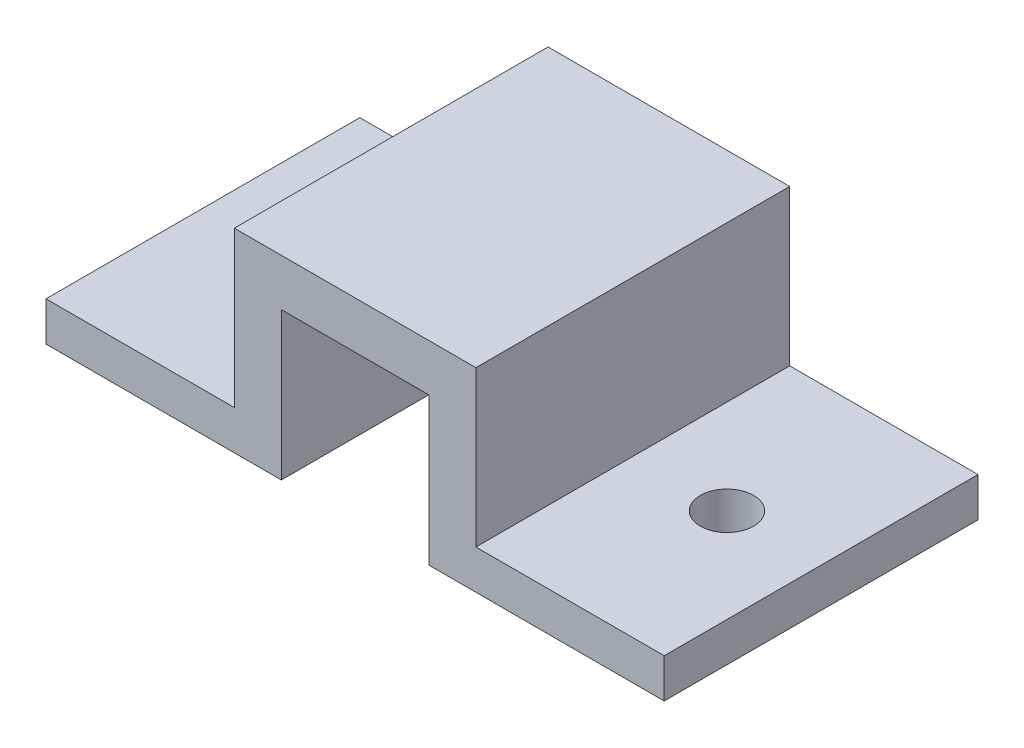
ISO-10303-21;
HEADER;
FILE_DESCRIPTION(('STEP AP214'),'2;1');
FILE_NAME('part.step','',(''),(''),'','','');
FILE_SCHEMA(('AUTOMOTIVE_DESIGN { 1 0 10303 214 1 1 1 1 }'));
ENDSEC;
DATA;
#1=APPLICATION_CONTEXT('core data for automotive mechanical design processes');
#2=APPLICATION_PROTOCOL_DEFINITION('international standard','automotive_design',2000,#1);
#3=PRODUCT_CONTEXT('',#1,'mechanical');
#4=PRODUCT('Part','Part','',(#3));
#5=PRODUCT_RELATED_PRODUCT_CATEGORY('part','',(#4));
#6=PRODUCT_DEFINITION_FORMATION('','',#4);
#7=PRODUCT_DEFINITION_CONTEXT('part definition',#1,'design');
#8=PRODUCT_DEFINITION('design','',#6,#7);
#9=PRODUCT_DEFINITION_SHAPE('','',#8);
#10=(LENGTH_UNIT() NAMED_UNIT(*) SI_UNIT(.MILLI.,.METRE.));
#11=(NAMED_UNIT(*) PLANE_ANGLE_UNIT() SI_UNIT($,.RADIAN.));
#12=(NAMED_UNIT(*) SI_UNIT($,.STERADIAN.) SOLID_ANGLE_UNIT());
#13=UNCERTAINTY_MEASURE_WITH_UNIT(LENGTH_MEASURE(1.E-05),#10,'distance_accuracy_value','');
#14=(GEOMETRIC_REPRESENTATION_CONTEXT(3) GLOBAL_UNCERTAINTY_ASSIGNED_CONTEXT((#13)) GLOBAL_UNIT_ASSIGNED_CONTEXT((#10,
#11,#12)) REPRESENTATION_CONTEXT('',''));
#15=CARTESIAN_POINT('',(0.,0.,0.));
#16=DIRECTION('',(0.,0.,1.));
#17=DIRECTION('',(1.,0.,0.));
#18=AXIS2_PLACEMENT_3D('',#15,#16,#17);
#19=CARTESIAN_POINT('',(21.9787589866717,-10.1497377982631,25.4));
#20=DIRECTION('',(-1.,0.,0.));
#21=DIRECTION('',(0.,0.,1.));
#22=AXIS2_PLACEMENT_3D('',#19,#20,#21);
#23=PLANE('',#22);
#24=DIRECTION('',(0.,1.,0.));
#25=VECTOR('',#24,1.);
#26=CARTESIAN_POINT('',(21.9787589866717,-10.1497377982631,0.));
#27=LINE('',#26,#25);
#28=CARTESIAN_POINT('',(21.9787589866717,-10.1497377982631,0.));
#29=VERTEX_POINT('',#28);
#30=CARTESIAN_POINT('',(21.9787589866717,-6.97473779826315,0.));
#31=VERTEX_POINT('',#30);
#32=EDGE_CURVE('E156',#29,#31,#27,.T.);
#33=ORIENTED_EDGE('',*,*,#32,.T.);
#34=DIRECTION('',(0.,0.,-1.));
#35=VECTOR('',#34,1.);
#36=CARTESIAN_POINT('',(21.9787589866717,-6.97473779826315,25.4));
#37=LINE('',#36,#35);
#38=CARTESIAN_POINT('',(21.9787589866717,-6.97473779826315,25.4));
#39=VERTEX_POINT('',#38);
#40=EDGE_CURVE('E11',#39,#31,#37,.T.);
#41=ORIENTED_EDGE('',*,*,#40,.F.);
#42=DIRECTION('',(0.,1.,0.));
#43=VECTOR('',#42,1.);
#44=CARTESIAN_POINT('',(21.9787589866717,-10.1497377982631,25.4));
#45=LINE('',#44,#43);
#46=CARTESIAN_POINT('',(21.9787589866717,-10.1497377982631,25.4));
#47=VERTEX_POINT('',#46);
#48=EDGE_CURVE('E179',#47,#39,#45,.T.);
#49=ORIENTED_EDGE('',*,*,#48,.F.);
#50=DIRECTION('',(0.,0.,-1.));
#51=VECTOR('',#50,1.);
#52=CARTESIAN_POINT('',(21.9787589866717,-10.1497377982631,25.4));
#53=LINE('',#52,#51);
#54=EDGE_CURVE('E152',#47,#29,#53,.T.);
#55=ORIENTED_EDGE('',*,*,#54,.T.);
#56=EDGE_LOOP('',(#33,#41,#49,#55));
#57=FACE_BOUND('',#56,.T.);
#58=ADVANCED_FACE('F34',(#57),#23,.F.);
#59=CARTESIAN_POINT('',(6.73875898667166,-6.97473779826315,25.4));
#60=DIRECTION('',(0.,-1.,0.));
#61=DIRECTION('',(0.,0.,-1.));
#62=AXIS2_PLACEMENT_3D('',#59,#60,#61);
#63=PLANE('',#62);
#64=CARTESIAN_POINT('',(14.3587589866717,-6.97473779826315,12.7));
#65=DIRECTION('',(0.,1.,0.));
#66=DIRECTION('',(0.,0.,1.));
#67=AXIS2_PLACEMENT_3D('',#64,#65,#66);
#68=CIRCLE('',#67,2.159);
#69=CARTESIAN_POINT('',(14.3587589866717,-6.97473779826315,14.859));
#70=VERTEX_POINT('',#69);
#71=EDGE_CURVE('E203',#70,#70,#68,.T.);
#72=ORIENTED_EDGE('',*,*,#71,.F.);
#73=EDGE_LOOP('',(#72));
#74=FACE_BOUND('',#73,.T.);
#75=DIRECTION('',(-1.,0.,0.));
#76=VECTOR('',#75,1.);
#77=CARTESIAN_POINT('',(6.73875898667166,-6.97473779826315,0.));
#78=LINE('',#77,#76);
#79=CARTESIAN_POINT('',(6.73875898667166,-6.97473779826315,0.));
#80=VERTEX_POINT('',#79);
#81=EDGE_CURVE('E159',#31,#80,#78,.T.);
#82=ORIENTED_EDGE('',*,*,#81,.T.);
#83=DIRECTION('',(0.,0.,-1.));
#84=VECTOR('',#83,1.);
#85=CARTESIAN_POINT('',(6.73875898667166,-6.97473779826315,25.4));
#86=LINE('',#85,#84);
#87=CARTESIAN_POINT('',(6.73875898667166,-6.97473779826315,25.4));
#88=VERTEX_POINT('',#87);
#89=EDGE_CURVE('E43',#88,#80,#86,.T.);
#90=ORIENTED_EDGE('',*,*,#89,.F.);
#91=DIRECTION('',(-1.,0.,0.));
#92=VECTOR('',#91,1.);
#93=CARTESIAN_POINT('',(6.73875898667166,-6.97473779826315,25.4));
#94=LINE('',#93,#92);
#95=EDGE_CURVE('E107',#39,#88,#94,.T.);
#96=ORIENTED_EDGE('',*,*,#95,.F.);
#97=ORIENTED_EDGE('',*,*,#40,.T.);
#98=EDGE_LOOP('',(#82,#90,#96,#97));
#99=FACE_BOUND('',#98,.T.);
#100=ADVANCED_FACE('F255',(#74,#99),#63,.F.);
#101=CARTESIAN_POINT('',(6.73875898667166,5.59826220173685,25.4));
#102=DIRECTION('',(-1.,0.,0.));
#103=DIRECTION('',(0.,0.,1.));
#104=AXIS2_PLACEMENT_3D('',#101,#102,#103);
#105=PLANE('',#104);
#106=DIRECTION('',(0.,1.,0.));
#107=VECTOR('',#106,1.);
#108=CARTESIAN_POINT('',(6.73875898667166,5.59826220173685,0.));
#109=LINE('',#108,#107);
#110=CARTESIAN_POINT('',(6.73875898667166,5.59826220173685,0.));
#111=VERTEX_POINT('',#110);
#112=EDGE_CURVE('E162',#80,#111,#109,.T.);
#113=ORIENTED_EDGE('',*,*,#112,.T.);
#114=DIRECTION('',(0.,0.,-1.));
#115=VECTOR('',#114,1.);
#116=CARTESIAN_POINT('',(6.73875898667166,5.59826220173685,25.4));
#117=LINE('',#116,#115);
#118=CARTESIAN_POINT('',(6.73875898667166,5.59826220173685,25.4));
#119=VERTEX_POINT('',#118);
#120=EDGE_CURVE('E198',#119,#111,#117,.T.);
#121=ORIENTED_EDGE('',*,*,#120,.F.);
#122=DIRECTION('',(0.,1.,0.));
#123=VECTOR('',#122,1.);
#124=CARTESIAN_POINT('',(6.73875898667166,5.59826220173685,25.4));
#125=LINE('',#124,#123);
#126=EDGE_CURVE('E216',#88,#119,#125,.T.);
#127=ORIENTED_EDGE('',*,*,#126,.F.);
#128=ORIENTED_EDGE('',*,*,#89,.T.);
#129=EDGE_LOOP('',(#113,#121,#127,#128));
#130=FACE_BOUND('',#129,.T.);
#131=ADVANCED_FACE('F259',(#130),#105,.F.);
#132=CARTESIAN_POINT('',(-12.8192410133283,5.59826220173685,25.4));
#133=DIRECTION('',(0.,-1.,0.));
#134=DIRECTION('',(0.,0.,-1.));
#135=AXIS2_PLACEMENT_3D('',#132,#133,#134);
#136=PLANE('',#135);
#137=DIRECTION('',(-1.,0.,0.));
#138=VECTOR('',#137,1.);
#139=CARTESIAN_POINT('',(-12.8192410133283,5.59826220173685,0.));
#140=LINE('',#139,#138);
#141=CARTESIAN_POINT('',(-12.8192410133283,5.59826220173685,0.));
#142=VERTEX_POINT('',#141);
#143=EDGE_CURVE('E164',#111,#142,#140,.T.);
#144=ORIENTED_EDGE('',*,*,#143,.T.);
#145=DIRECTION('',(0.,0.,-1.));
#146=VECTOR('',#145,1.);
#147=CARTESIAN_POINT('',(-12.8192410133283,5.59826220173685,25.4));
#148=LINE('',#147,#146);
#149=CARTESIAN_POINT('',(-12.8192410133283,5.59826220173685,25.4));
#150=VERTEX_POINT('',#149);
#151=EDGE_CURVE('E195',#150,#142,#148,.T.);
#152=ORIENTED_EDGE('',*,*,#151,.F.);
#153=DIRECTION('',(-1.,0.,0.));
#154=VECTOR('',#153,1.);
#155=CARTESIAN_POINT('',(-12.8192410133283,5.59826220173685,25.4));
#156=LINE('',#155,#154);
#157=EDGE_CURVE('E218',#119,#150,#156,.T.);
#158=ORIENTED_EDGE('',*,*,#157,.F.);
#159=ORIENTED_EDGE('',*,*,#120,.T.);
#160=EDGE_LOOP('',(#144,#152,#158,#159));
#161=FACE_BOUND('',#160,.T.);
#162=ADVANCED_FACE('F264',(#161),#136,.F.);
#163=CARTESIAN_POINT('',(-12.8192410133283,-6.97473779826315,25.4));
#164=DIRECTION('',(1.,0.,0.));
#165=DIRECTION('',(0.,0.,-1.));
#166=AXIS2_PLACEMENT_3D('',#163,#164,#165);
#167=PLANE('',#166);
#168=DIRECTION('',(0.,-1.,0.));
#169=VECTOR('',#168,1.);
#170=CARTESIAN_POINT('',(-12.8192410133283,-6.97473779826315,0.));
#171=LINE('',#170,#169);
#172=CARTESIAN_POINT('',(-12.8192410133283,-6.97473779826315,0.));
#173=VERTEX_POINT('',#172);
#174=EDGE_CURVE('E166',#142,#173,#171,.T.);
#175=ORIENTED_EDGE('',*,*,#174,.T.);
#176=DIRECTION('',(0.,0.,-1.));
#177=VECTOR('',#176,1.);
#178=CARTESIAN_POINT('',(-12.8192410133283,-6.97473779826315,25.4));
#179=LINE('',#178,#177);
#180=CARTESIAN_POINT('',(-12.8192410133283,-6.97473779826315,25.4));
#181=VERTEX_POINT('',#180);
#182=EDGE_CURVE('E192',#181,#173,#179,.T.);
#183=ORIENTED_EDGE('',*,*,#182,.F.);
#184=DIRECTION('',(0.,-1.,0.));
#185=VECTOR('',#184,1.);
#186=CARTESIAN_POINT('',(-12.8192410133283,-6.97473779826315,25.4));
#187=LINE('',#186,#185);
#188=EDGE_CURVE('E220',#150,#181,#187,.T.);
#189=ORIENTED_EDGE('',*,*,#188,.F.);
#190=ORIENTED_EDGE('',*,*,#151,.T.);
#191=EDGE_LOOP('',(#175,#183,#189,#190));
#192=FACE_BOUND('',#191,.T.);
#193=ADVANCED_FACE('F270',(#192),#167,.F.);
#194=CARTESIAN_POINT('',(-28.0592410133283,-6.97473779826315,25.4));
#195=DIRECTION('',(0.,-1.,0.));
#196=DIRECTION('',(0.,0.,-1.));
#197=AXIS2_PLACEMENT_3D('',#194,#195,#196);
#198=PLANE('',#197);
#199=CARTESIAN_POINT('',(-20.4392410133283,-6.97473779826315,12.7));
#200=DIRECTION('',(0.,1.,0.));
#201=DIRECTION('',(0.,0.,1.));
#202=AXIS2_PLACEMENT_3D('',#199,#200,#201);
#203=CIRCLE('',#202,2.159);
#204=CARTESIAN_POINT('',(-20.4392410133283,-6.97473779826315,14.859));
#205=VERTEX_POINT('',#204);
#206=EDGE_CURVE('E211',#205,#205,#203,.T.);
#207=ORIENTED_EDGE('',*,*,#206,.F.);
#208=EDGE_LOOP('',(#207));
#209=FACE_BOUND('',#208,.T.);
#210=DIRECTION('',(-1.,0.,0.));
#211=VECTOR('',#210,1.);
#212=CARTESIAN_POINT('',(-28.0592410133283,-6.97473779826315,0.));
#213=LINE('',#212,#211);
#214=CARTESIAN_POINT('',(-28.0592410133283,-6.97473779826315,0.));
#215=VERTEX_POINT('',#214);
#216=EDGE_CURVE('E168',#173,#215,#213,.T.);
#217=ORIENTED_EDGE('',*,*,#216,.T.);
#218=DIRECTION('',(0.,0.,-1.));
#219=VECTOR('',#218,1.);
#220=CARTESIAN_POINT('',(-28.0592410133283,-6.97473779826315,25.4));
#221=LINE('',#220,#219);
#222=CARTESIAN_POINT('',(-28.0592410133283,-6.97473779826315,25.4));
#223=VERTEX_POINT('',#222);
#224=EDGE_CURVE('E189',#223,#215,#221,.T.);
#225=ORIENTED_EDGE('',*,*,#224,.F.);
#226=DIRECTION('',(-1.,0.,0.));
#227=VECTOR('',#226,1.);
#228=CARTESIAN_POINT('',(-28.0592410133283,-6.97473779826315,25.4));
#229=LINE('',#228,#227);
#230=EDGE_CURVE('E222',#181,#223,#229,.T.);
#231=ORIENTED_EDGE('',*,*,#230,.F.);
#232=ORIENTED_EDGE('',*,*,#182,.T.);
#233=EDGE_LOOP('',(#217,#225,#231,#232));
#234=FACE_BOUND('',#233,.T.);
#235=ADVANCED_FACE('F274',(#209,#234),#198,.F.);
#236=CARTESIAN_POINT('',(-28.0592410133283,-10.1497377982632,25.4));
#237=DIRECTION('',(1.,0.,0.));
#238=DIRECTION('',(0.,0.,-1.));
#239=AXIS2_PLACEMENT_3D('',#236,#237,#238);
#240=PLANE('',#239);
#241=DIRECTION('',(0.,-1.,0.));
#242=VECTOR('',#241,1.);
#243=CARTESIAN_POINT('',(-28.0592410133283,-10.1497377982632,0.));
#244=LINE('',#243,#242);
#245=CARTESIAN_POINT('',(-28.0592410133283,-10.1497377982632,0.));
#246=VERTEX_POINT('',#245);
#247=EDGE_CURVE('E170',#215,#246,#244,.T.);
#248=ORIENTED_EDGE('',*,*,#247,.T.);
#249=DIRECTION('',(0.,0.,-1.));
#250=VECTOR('',#249,1.);
#251=CARTESIAN_POINT('',(-28.0592410133283,-10.1497377982632,25.4));
#252=LINE('',#251,#250);
#253=CARTESIAN_POINT('',(-28.0592410133283,-10.1497377982632,25.4));
#254=VERTEX_POINT('',#253);
#255=EDGE_CURVE('E186',#254,#246,#252,.T.);
#256=ORIENTED_EDGE('',*,*,#255,.F.);
#257=DIRECTION('',(0.,-1.,0.));
#258=VECTOR('',#257,1.);
#259=CARTESIAN_POINT('',(-28.0592410133283,-10.1497377982632,25.4));
#260=LINE('',#259,#258);
#261=EDGE_CURVE('E224',#223,#254,#260,.T.);
#262=ORIENTED_EDGE('',*,*,#261,.F.);
#263=ORIENTED_EDGE('',*,*,#224,.T.);
#264=EDGE_LOOP('',(#248,#256,#262,#263));
#265=FACE_BOUND('',#264,.T.);
#266=ADVANCED_FACE('F278',(#265),#240,.F.);
#267=CARTESIAN_POINT('',(-9.00924101332834,-10.1497377982631,25.4));
#268=DIRECTION('',(0.,1.,0.));
#269=DIRECTION('',(-1.,0.,0.));
#270=AXIS2_PLACEMENT_3D('',#267,#268,#269);
#271=PLANE('',#270);
#272=CARTESIAN_POINT('',(-20.4392410133283,-10.1497377982631,12.7));
#273=DIRECTION('',(0.,1.,0.));
#274=DIRECTION('',(-1.,0.,0.));
#275=AXIS2_PLACEMENT_3D('',#272,#273,#274);
#276=CIRCLE('',#275,2.159);
#277=CARTESIAN_POINT('',(-22.5982410133283,-10.1497377982631,12.7));
#278=VERTEX_POINT('',#277);
#279=EDGE_CURVE('E37',#278,#278,#276,.T.);
#280=ORIENTED_EDGE('',*,*,#279,.T.);
#281=EDGE_LOOP('',(#280));
#282=FACE_BOUND('',#281,.T.);
#283=DIRECTION('',(1.,0.,0.));
#284=VECTOR('',#283,1.);
#285=CARTESIAN_POINT('',(-9.00924101332834,-10.1497377982631,0.));
#286=LINE('',#285,#284);
#287=CARTESIAN_POINT('',(-9.00924101332834,-10.1497377982631,0.));
#288=VERTEX_POINT('',#287);
#289=EDGE_CURVE('E172',#246,#288,#286,.T.);
#290=ORIENTED_EDGE('',*,*,#289,.T.);
#291=DIRECTION('',(0.,0.,-1.));
#292=VECTOR('',#291,1.);
#293=CARTESIAN_POINT('',(-9.00924101332834,-10.1497377982631,25.4));
#294=LINE('',#293,#292);
#295=CARTESIAN_POINT('',(-9.00924101332834,-10.1497377982631,25.4));
#296=VERTEX_POINT('',#295);
#297=EDGE_CURVE('E183',#296,#288,#294,.T.);
#298=ORIENTED_EDGE('',*,*,#297,.F.);
#299=DIRECTION('',(1.,0.,0.));
#300=VECTOR('',#299,1.);
#301=CARTESIAN_POINT('',(-9.00924101332834,-10.1497377982631,25.4));
#302=LINE('',#301,#300);
#303=EDGE_CURVE('E226',#254,#296,#302,.T.);
#304=ORIENTED_EDGE('',*,*,#303,.F.);
#305=ORIENTED_EDGE('',*,*,#255,.T.);
#306=EDGE_LOOP('',(#290,#298,#304,#305));
#307=FACE_BOUND('',#306,.T.);
#308=ADVANCED_FACE('F232',(#282,#307),#271,.F.);
#309=CARTESIAN_POINT('',(-9.00924101332834,-10.1497377982631,25.4));
#310=DIRECTION('',(-1.,0.,0.));
#311=DIRECTION('',(0.,0.,1.));
#312=AXIS2_PLACEMENT_3D('',#309,#310,#311);
#313=PLANE('',#312);
#314=DIRECTION('',(0.,1.,0.));
#315=VECTOR('',#314,1.);
#316=CARTESIAN_POINT('',(-9.00924101332834,-10.1497377982631,0.));
#317=LINE('',#316,#315);
#318=CARTESIAN_POINT('',(-9.00924101332834,1.78826220173685,0.));
#319=VERTEX_POINT('',#318);
#320=EDGE_CURVE('E174',#288,#319,#317,.T.);
#321=ORIENTED_EDGE('',*,*,#320,.T.);
#322=DIRECTION('',(0.,0.,-1.));
#323=VECTOR('',#322,1.);
#324=CARTESIAN_POINT('',(-9.00924101332834,1.78826220173685,25.4));
#325=LINE('',#324,#323);
#326=CARTESIAN_POINT('',(-9.00924101332834,1.78826220173685,25.4));
#327=VERTEX_POINT('',#326);
#328=EDGE_CURVE('E147',#327,#319,#325,.T.);
#329=ORIENTED_EDGE('',*,*,#328,.F.);
#330=DIRECTION('',(0.,1.,0.));
#331=VECTOR('',#330,1.);
#332=CARTESIAN_POINT('',(-9.00924101332834,-10.1497377982631,25.4));
#333=LINE('',#332,#331);
#334=EDGE_CURVE('E138',#296,#327,#333,.T.);
#335=ORIENTED_EDGE('',*,*,#334,.F.);
#336=ORIENTED_EDGE('',*,*,#297,.T.);
#337=EDGE_LOOP('',(#321,#329,#335,#336));
#338=FACE_BOUND('',#337,.T.);
#339=ADVANCED_FACE('F236',(#338),#313,.F.);
#340=CARTESIAN_POINT('',(2.92875898667165,1.78826220173685,25.4));
#341=DIRECTION('',(0.,1.,0.));
#342=DIRECTION('',(-1.,0.,0.));
#343=AXIS2_PLACEMENT_3D('',#340,#341,#342);
#344=PLANE('',#343);
#345=DIRECTION('',(1.,0.,0.));
#346=VECTOR('',#345,1.);
#347=CARTESIAN_POINT('',(2.92875898667165,1.78826220173685,0.));
#348=LINE('',#347,#346);
#349=CARTESIAN_POINT('',(2.92875898667165,1.78826220173685,0.));
#350=VERTEX_POINT('',#349);
#351=EDGE_CURVE('E146',#319,#350,#348,.T.);
#352=ORIENTED_EDGE('',*,*,#351,.T.);
#353=DIRECTION('',(0.,0.,-1.));
#354=VECTOR('',#353,1.);
#355=CARTESIAN_POINT('',(2.92875898667165,1.78826220173685,25.4));
#356=LINE('',#355,#354);
#357=CARTESIAN_POINT('',(2.92875898667165,1.78826220173685,25.4));
#358=VERTEX_POINT('',#357);
#359=EDGE_CURVE('E143',#358,#350,#356,.T.);
#360=ORIENTED_EDGE('',*,*,#359,.F.);
#361=DIRECTION('',(1.,0.,0.));
#362=VECTOR('',#361,1.);
#363=CARTESIAN_POINT('',(2.92875898667165,1.78826220173685,25.4));
#364=LINE('',#363,#362);
#365=EDGE_CURVE('E132',#327,#358,#364,.T.);
#366=ORIENTED_EDGE('',*,*,#365,.F.);
#367=ORIENTED_EDGE('',*,*,#328,.T.);
#368=EDGE_LOOP('',(#352,#360,#366,#367));
#369=FACE_BOUND('',#368,.T.);
#370=ADVANCED_FACE('F144',(#369),#344,.F.);
#371=CARTESIAN_POINT('',(2.92875898667165,-10.1497377982631,25.4));
#372=DIRECTION('',(1.,0.,0.));
#373=DIRECTION('',(0.,0.,-1.));
#374=AXIS2_PLACEMENT_3D('',#371,#372,#373);
#375=PLANE('',#374);
#376=DIRECTION('',(0.,-1.,0.));
#377=VECTOR('',#376,1.);
#378=CARTESIAN_POINT('',(2.92875898667165,-10.1497377982631,0.));
#379=LINE('',#378,#377);
#380=CARTESIAN_POINT('',(2.92875898667165,-10.1497377982631,0.));
#381=VERTEX_POINT('',#380);
#382=EDGE_CURVE('E93',#350,#381,#379,.T.);
#383=ORIENTED_EDGE('',*,*,#382,.T.);
#384=DIRECTION('',(0.,0.,-1.));
#385=VECTOR('',#384,1.);
#386=CARTESIAN_POINT('',(2.92875898667165,-10.1497377982631,25.4));
#387=LINE('',#386,#385);
#388=CARTESIAN_POINT('',(2.92875898667165,-10.1497377982631,25.4));
#389=VERTEX_POINT('',#388);
#390=EDGE_CURVE('E148',#389,#381,#387,.T.);
#391=ORIENTED_EDGE('',*,*,#390,.F.);
#392=DIRECTION('',(0.,-1.,0.));
#393=VECTOR('',#392,1.);
#394=CARTESIAN_POINT('',(2.92875898667165,-10.1497377982631,25.4));
#395=LINE('',#394,#393);
#396=EDGE_CURVE('E136',#358,#389,#395,.T.);
#397=ORIENTED_EDGE('',*,*,#396,.F.);
#398=ORIENTED_EDGE('',*,*,#359,.T.);
#399=EDGE_LOOP('',(#383,#391,#397,#398));
#400=FACE_BOUND('',#399,.T.);
#401=ADVANCED_FACE('F150',(#400),#375,.F.);
#402=CARTESIAN_POINT('',(21.9787589866717,-10.1497377982631,25.4));
#403=DIRECTION('',(0.,1.,0.));
#404=DIRECTION('',(-1.,0.,0.));
#405=AXIS2_PLACEMENT_3D('',#402,#403,#404);
#406=PLANE('',#405);
#407=CARTESIAN_POINT('',(14.3587589866717,-10.1497377982631,12.7));
#408=DIRECTION('',(0.,1.,0.));
#409=DIRECTION('',(-1.,0.,0.));
#410=AXIS2_PLACEMENT_3D('',#407,#408,#409);
#411=CIRCLE('',#410,2.159);
#412=CARTESIAN_POINT('',(12.1997589866717,-10.1497377982631,12.7));
#413=VERTEX_POINT('',#412);
#414=EDGE_CURVE('E160',#413,#413,#411,.T.);
#415=ORIENTED_EDGE('',*,*,#414,.T.);
#416=EDGE_LOOP('',(#415));
#417=FACE_BOUND('',#416,.T.);
#418=DIRECTION('',(1.,0.,0.));
#419=VECTOR('',#418,1.);
#420=CARTESIAN_POINT('',(21.9787589866717,-10.1497377982631,0.));
#421=LINE('',#420,#419);
#422=EDGE_CURVE('E99',#381,#29,#421,.T.);
#423=ORIENTED_EDGE('',*,*,#422,.T.);
#424=ORIENTED_EDGE('',*,*,#54,.F.);
#425=DIRECTION('',(1.,0.,0.));
#426=VECTOR('',#425,1.);
#427=CARTESIAN_POINT('',(21.9787589866717,-10.1497377982631,25.4));
#428=LINE('',#427,#426);
#429=EDGE_CURVE('E52',#389,#47,#428,.T.);
#430=ORIENTED_EDGE('',*,*,#429,.F.);
#431=ORIENTED_EDGE('',*,*,#390,.T.);
#432=EDGE_LOOP('',(#423,#424,#430,#431));
#433=FACE_BOUND('',#432,.T.);
#434=ADVANCED_FACE('F244',(#417,#433),#406,.F.);
#435=CARTESIAN_POINT('',(0.,0.,25.4));
#436=DIRECTION('',(0.,0.,-1.));
#437=DIRECTION('',(-1.,0.,0.));
#438=AXIS2_PLACEMENT_3D('',#435,#436,#437);
#439=PLANE('',#438);
#440=ORIENTED_EDGE('',*,*,#48,.T.);
#441=ORIENTED_EDGE('',*,*,#95,.T.);
#442=ORIENTED_EDGE('',*,*,#126,.T.);
#443=ORIENTED_EDGE('',*,*,#157,.T.);
#444=ORIENTED_EDGE('',*,*,#188,.T.);
#445=ORIENTED_EDGE('',*,*,#230,.T.);
#446=ORIENTED_EDGE('',*,*,#261,.T.);
#447=ORIENTED_EDGE('',*,*,#303,.T.);
#448=ORIENTED_EDGE('',*,*,#334,.T.);
#449=ORIENTED_EDGE('',*,*,#365,.T.);
#450=ORIENTED_EDGE('',*,*,#396,.T.);
#451=ORIENTED_EDGE('',*,*,#429,.T.);
#452=EDGE_LOOP('',(#440,#441,#442,#443,#444,#445,#446,#447,#448,#449,#450,#451));
#453=FACE_BOUND('',#452,.T.);
#454=ADVANCED_FACE('F134',(#453),#439,.F.);
#455=CARTESIAN_POINT('',(0.,0.,0.));
#456=DIRECTION('',(0.,0.,-1.));
#457=DIRECTION('',(-1.,0.,0.));
#458=AXIS2_PLACEMENT_3D('',#455,#456,#457);
#459=PLANE('',#458);
#460=ORIENTED_EDGE('',*,*,#32,.F.);
#461=ORIENTED_EDGE('',*,*,#422,.F.);
#462=ORIENTED_EDGE('',*,*,#382,.F.);
#463=ORIENTED_EDGE('',*,*,#351,.F.);
#464=ORIENTED_EDGE('',*,*,#320,.F.);
#465=ORIENTED_EDGE('',*,*,#289,.F.);
#466=ORIENTED_EDGE('',*,*,#247,.F.);
#467=ORIENTED_EDGE('',*,*,#216,.F.);
#468=ORIENTED_EDGE('',*,*,#174,.F.);
#469=ORIENTED_EDGE('',*,*,#143,.F.);
#470=ORIENTED_EDGE('',*,*,#112,.F.);
#471=ORIENTED_EDGE('',*,*,#81,.F.);
#472=EDGE_LOOP('',(#460,#461,#462,#463,#464,#465,#466,#467,#468,#469,#470,#471));
#473=FACE_BOUND('',#472,.T.);
#474=ADVANCED_FACE('F239',(#473),#459,.T.);
#475=CARTESIAN_POINT('',(14.3587589866717,-32.3747377982631,12.7));
#476=DIRECTION('',(0.,1.,0.));
#477=DIRECTION('',(0.,0.,1.));
#478=AXIS2_PLACEMENT_3D('',#475,#476,#477);
#479=CYLINDRICAL_SURFACE('',#478,2.159);
#480=ORIENTED_EDGE('',*,*,#71,.T.);
#481=EDGE_LOOP('',(#480));
#482=FACE_BOUND('',#481,.T.);
#483=ORIENTED_EDGE('',*,*,#414,.F.);
#484=EDGE_LOOP('',(#483));
#485=FACE_BOUND('',#484,.T.);
#486=ADVANCED_FACE('F312',(#482,#485),#479,.F.);
#487=CARTESIAN_POINT('',(-20.4392410133283,-32.3747377982631,12.7));
#488=DIRECTION('',(0.,1.,0.));
#489=DIRECTION('',(0.,0.,1.));
#490=AXIS2_PLACEMENT_3D('',#487,#488,#489);
#491=CYLINDRICAL_SURFACE('',#490,2.159);
#492=ORIENTED_EDGE('',*,*,#206,.T.);
#493=EDGE_LOOP('',(#492));
#494=FACE_BOUND('',#493,.T.);
#495=ORIENTED_EDGE('',*,*,#279,.F.);
#496=EDGE_LOOP('',(#495));
#497=FACE_BOUND('',#496,.T.);
#498=ADVANCED_FACE('F330',(#494,#497),#491,.F.);
#499=CLOSED_SHELL('',(#58,#100,#131,#162,#193,#235,#266,#308,#339,#370,#401,#434,#454,#474,#486,#498));
#500=MANIFOLD_SOLID_BREP('B2',#499);
#501=ADVANCED_BREP_SHAPE_REPRESENTATION('',(#18,#500),#14);
#502=SHAPE_DEFINITION_REPRESENTATION(#9,#501);
ENDSEC;
END-ISO-10303-21;
